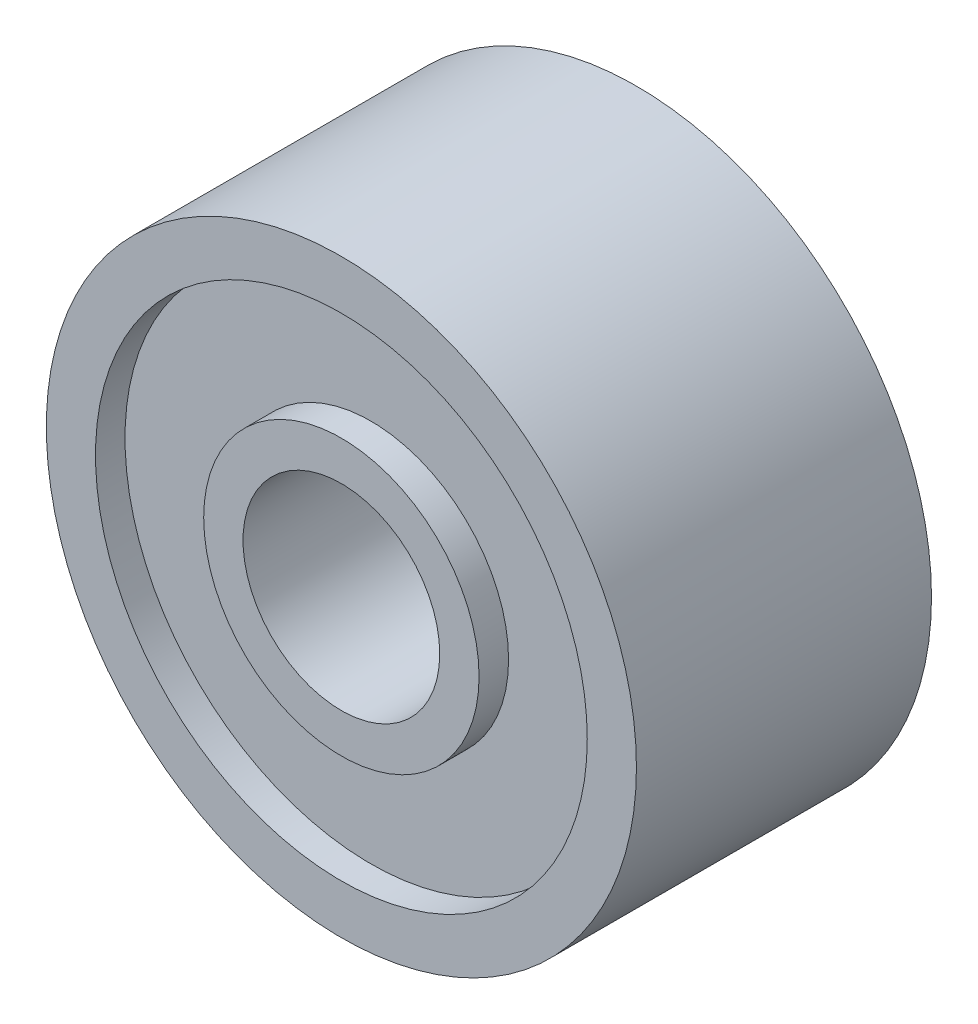
ISO-10303-21;
HEADER;
FILE_DESCRIPTION(('STEP AP214'),'2;1');
FILE_NAME('part.step','',(''),(''),'','','');
FILE_SCHEMA(('AUTOMOTIVE_DESIGN { 1 0 10303 214 1 1 1 1 }'));
ENDSEC;
DATA;
#1=APPLICATION_CONTEXT('core data for automotive mechanical design processes');
#2=APPLICATION_PROTOCOL_DEFINITION('international standard','automotive_design',2000,#1);
#3=PRODUCT_CONTEXT('',#1,'mechanical');
#4=PRODUCT('Part','Part','',(#3));
#5=PRODUCT_RELATED_PRODUCT_CATEGORY('part','',(#4));
#6=PRODUCT_DEFINITION_FORMATION('','',#4);
#7=PRODUCT_DEFINITION_CONTEXT('part definition',#1,'design');
#8=PRODUCT_DEFINITION('design','',#6,#7);
#9=PRODUCT_DEFINITION_SHAPE('','',#8);
#10=(LENGTH_UNIT() NAMED_UNIT(*) SI_UNIT(.MILLI.,.METRE.));
#11=(NAMED_UNIT(*) PLANE_ANGLE_UNIT() SI_UNIT($,.RADIAN.));
#12=(NAMED_UNIT(*) SI_UNIT($,.STERADIAN.) SOLID_ANGLE_UNIT());
#13=UNCERTAINTY_MEASURE_WITH_UNIT(LENGTH_MEASURE(1.E-05),#10,'distance_accuracy_value','');
#14=(GEOMETRIC_REPRESENTATION_CONTEXT(3) GLOBAL_UNCERTAINTY_ASSIGNED_CONTEXT((#13)) GLOBAL_UNIT_ASSIGNED_CONTEXT((#10,
#11,#12)) REPRESENTATION_CONTEXT('',''));
#15=CARTESIAN_POINT('',(0.,0.,0.));
#16=DIRECTION('',(0.,0.,1.));
#17=DIRECTION('',(1.,0.,0.));
#18=AXIS2_PLACEMENT_3D('',#15,#16,#17);
#19=CARTESIAN_POINT('',(0.,0.,0.));
#20=DIRECTION('',(0.,0.,1.));
#21=DIRECTION('',(1.,0.,0.));
#22=AXIS2_PLACEMENT_3D('',#19,#20,#21);
#23=PLANE('',#22);
#24=CARTESIAN_POINT('',(0.,0.,0.));
#25=DIRECTION('',(0.,0.,1.));
#26=DIRECTION('',(1.,0.,0.));
#27=AXIS2_PLACEMENT_3D('',#24,#25,#26);
#28=CIRCLE('',#27,1.);
#29=CARTESIAN_POINT('',(1.,0.,0.));
#30=VERTEX_POINT('',#29);
#31=EDGE_CURVE('E46',#30,#30,#28,.T.);
#32=ORIENTED_EDGE('',*,*,#31,.T.);
#33=EDGE_LOOP('',(#32));
#34=FACE_BOUND('',#33,.T.);
#35=CARTESIAN_POINT('',(0.,0.,0.));
#36=DIRECTION('',(0.,0.,1.));
#37=DIRECTION('',(1.,0.,0.));
#38=AXIS2_PLACEMENT_3D('',#35,#36,#37);
#39=CIRCLE('',#38,1.4);
#40=CARTESIAN_POINT('',(1.4,0.,0.));
#41=VERTEX_POINT('',#40);
#42=EDGE_CURVE('E70',#41,#41,#39,.T.);
#43=ORIENTED_EDGE('',*,*,#42,.F.);
#44=EDGE_LOOP('',(#43));
#45=FACE_BOUND('',#44,.T.);
#46=ADVANCED_FACE('F33',(#34,#45),#23,.F.);
#47=CARTESIAN_POINT('',(0.,0.,3.));
#48=DIRECTION('',(0.,0.,1.));
#49=DIRECTION('',(1.,0.,0.));
#50=AXIS2_PLACEMENT_3D('',#47,#48,#49);
#51=PLANE('',#50);
#52=CARTESIAN_POINT('',(0.,0.,3.));
#53=DIRECTION('',(0.,0.,1.));
#54=DIRECTION('',(1.,0.,0.));
#55=AXIS2_PLACEMENT_3D('',#52,#53,#54);
#56=CIRCLE('',#55,1.);
#57=CARTESIAN_POINT('',(1.,0.,3.));
#58=VERTEX_POINT('',#57);
#59=EDGE_CURVE('E44',#58,#58,#56,.T.);
#60=ORIENTED_EDGE('',*,*,#59,.F.);
#61=EDGE_LOOP('',(#60));
#62=FACE_BOUND('',#61,.T.);
#63=CARTESIAN_POINT('',(0.,0.,3.));
#64=DIRECTION('',(0.,0.,1.));
#65=DIRECTION('',(1.,0.,0.));
#66=AXIS2_PLACEMENT_3D('',#63,#64,#65);
#67=CIRCLE('',#66,1.4);
#68=CARTESIAN_POINT('',(1.4,0.,3.));
#69=VERTEX_POINT('',#68);
#70=EDGE_CURVE('E58',#69,#69,#67,.T.);
#71=ORIENTED_EDGE('',*,*,#70,.T.);
#72=EDGE_LOOP('',(#71));
#73=FACE_BOUND('',#72,.T.);
#74=ADVANCED_FACE('F86',(#62,#73),#51,.T.);
#75=CARTESIAN_POINT('',(0.,0.,3.));
#76=DIRECTION('',(0.,0.,1.));
#77=DIRECTION('',(1.,0.,0.));
#78=AXIS2_PLACEMENT_3D('',#75,#76,#77);
#79=CIRCLE('',#78,2.5);
#80=CARTESIAN_POINT('',(2.5,0.,3.));
#81=VERTEX_POINT('',#80);
#82=EDGE_CURVE('E52',#81,#81,#79,.T.);
#83=ORIENTED_EDGE('',*,*,#82,.F.);
#84=EDGE_LOOP('',(#83));
#85=FACE_BOUND('',#84,.T.);
#86=CARTESIAN_POINT('',(0.,0.,3.));
#87=DIRECTION('',(0.,0.,1.));
#88=DIRECTION('',(1.,0.,0.));
#89=AXIS2_PLACEMENT_3D('',#86,#87,#88);
#90=CIRCLE('',#89,3.);
#91=CARTESIAN_POINT('',(3.,0.,3.));
#92=VERTEX_POINT('',#91);
#93=EDGE_CURVE('E10',#92,#92,#90,.T.);
#94=ORIENTED_EDGE('',*,*,#93,.T.);
#95=EDGE_LOOP('',(#94));
#96=FACE_BOUND('',#95,.T.);
#97=ADVANCED_FACE('F92',(#85,#96),#51,.T.);
#98=CARTESIAN_POINT('',(0.,0.,0.));
#99=DIRECTION('',(0.,0.,1.));
#100=DIRECTION('',(1.,0.,0.));
#101=AXIS2_PLACEMENT_3D('',#98,#99,#100);
#102=CIRCLE('',#101,2.5);
#103=CARTESIAN_POINT('',(2.5,0.,0.));
#104=VERTEX_POINT('',#103);
#105=EDGE_CURVE('E64',#104,#104,#102,.T.);
#106=ORIENTED_EDGE('',*,*,#105,.T.);
#107=EDGE_LOOP('',(#106));
#108=FACE_BOUND('',#107,.T.);
#109=CARTESIAN_POINT('',(0.,0.,0.));
#110=DIRECTION('',(0.,0.,1.));
#111=DIRECTION('',(1.,0.,0.));
#112=AXIS2_PLACEMENT_3D('',#109,#110,#111);
#113=CIRCLE('',#112,3.);
#114=CARTESIAN_POINT('',(3.,0.,0.));
#115=VERTEX_POINT('',#114);
#116=EDGE_CURVE('E37',#115,#115,#113,.T.);
#117=ORIENTED_EDGE('',*,*,#116,.F.);
#118=EDGE_LOOP('',(#117));
#119=FACE_BOUND('',#118,.T.);
#120=ADVANCED_FACE('F88',(#108,#119),#23,.F.);
#121=CARTESIAN_POINT('',(0.,0.,3.));
#122=DIRECTION('',(0.,0.,-1.));
#123=DIRECTION('',(-1.,0.,0.));
#124=AXIS2_PLACEMENT_3D('',#121,#122,#123);
#125=CYLINDRICAL_SURFACE('',#124,3.);
#126=ORIENTED_EDGE('',*,*,#93,.F.);
#127=EDGE_LOOP('',(#126));
#128=FACE_BOUND('',#127,.T.);
#129=ORIENTED_EDGE('',*,*,#116,.T.);
#130=EDGE_LOOP('',(#129));
#131=FACE_BOUND('',#130,.T.);
#132=ADVANCED_FACE('F35',(#128,#131),#125,.T.);
#133=CARTESIAN_POINT('',(0.,0.,3.));
#134=DIRECTION('',(0.,0.,-1.));
#135=DIRECTION('',(-1.,0.,0.));
#136=AXIS2_PLACEMENT_3D('',#133,#134,#135);
#137=CYLINDRICAL_SURFACE('',#136,1.);
#138=ORIENTED_EDGE('',*,*,#59,.T.);
#139=EDGE_LOOP('',(#138));
#140=FACE_BOUND('',#139,.T.);
#141=ORIENTED_EDGE('',*,*,#31,.F.);
#142=EDGE_LOOP('',(#141));
#143=FACE_BOUND('',#142,.T.);
#144=ADVANCED_FACE('F101',(#140,#143),#137,.F.);
#145=CARTESIAN_POINT('',(0.,0.,2.7));
#146=DIRECTION('',(0.,0.,1.));
#147=DIRECTION('',(1.,0.,0.));
#148=AXIS2_PLACEMENT_3D('',#145,#146,#147);
#149=CYLINDRICAL_SURFACE('',#148,2.5);
#150=CARTESIAN_POINT('',(0.,0.,2.7));
#151=DIRECTION('',(0.,0.,1.));
#152=DIRECTION('',(1.,0.,0.));
#153=AXIS2_PLACEMENT_3D('',#150,#151,#152);
#154=CIRCLE('',#153,2.5);
#155=CARTESIAN_POINT('',(2.5,0.,2.7));
#156=VERTEX_POINT('',#155);
#157=EDGE_CURVE('E49',#156,#156,#154,.T.);
#158=ORIENTED_EDGE('',*,*,#157,.F.);
#159=EDGE_LOOP('',(#158));
#160=FACE_BOUND('',#159,.T.);
#161=ORIENTED_EDGE('',*,*,#82,.T.);
#162=EDGE_LOOP('',(#161));
#163=FACE_BOUND('',#162,.T.);
#164=ADVANCED_FACE('F125',(#160,#163),#149,.F.);
#165=CARTESIAN_POINT('',(0.,0.,2.7));
#166=DIRECTION('',(0.,0.,1.));
#167=DIRECTION('',(1.,0.,0.));
#168=AXIS2_PLACEMENT_3D('',#165,#166,#167);
#169=PLANE('',#168);
#170=CARTESIAN_POINT('',(0.,0.,2.7));
#171=DIRECTION('',(0.,0.,1.));
#172=DIRECTION('',(1.,0.,0.));
#173=AXIS2_PLACEMENT_3D('',#170,#171,#172);
#174=CIRCLE('',#173,1.4);
#175=CARTESIAN_POINT('',(1.4,0.,2.7));
#176=VERTEX_POINT('',#175);
#177=EDGE_CURVE('E55',#176,#176,#174,.T.);
#178=ORIENTED_EDGE('',*,*,#177,.F.);
#179=EDGE_LOOP('',(#178));
#180=FACE_BOUND('',#179,.T.);
#181=ORIENTED_EDGE('',*,*,#157,.T.);
#182=EDGE_LOOP('',(#181));
#183=FACE_BOUND('',#182,.T.);
#184=ADVANCED_FACE('F121',(#180,#183),#169,.T.);
#185=CARTESIAN_POINT('',(0.,0.,2.7));
#186=DIRECTION('',(0.,0.,1.));
#187=DIRECTION('',(1.,0.,0.));
#188=AXIS2_PLACEMENT_3D('',#185,#186,#187);
#189=CYLINDRICAL_SURFACE('',#188,1.4);
#190=ORIENTED_EDGE('',*,*,#177,.T.);
#191=EDGE_LOOP('',(#190));
#192=FACE_BOUND('',#191,.T.);
#193=ORIENTED_EDGE('',*,*,#70,.F.);
#194=EDGE_LOOP('',(#193));
#195=FACE_BOUND('',#194,.T.);
#196=ADVANCED_FACE('F115',(#192,#195),#189,.T.);
#197=CARTESIAN_POINT('',(0.,0.,0.3));
#198=DIRECTION('',(0.,0.,1.));
#199=DIRECTION('',(1.,0.,0.));
#200=AXIS2_PLACEMENT_3D('',#197,#198,#199);
#201=PLANE('',#200);
#202=CARTESIAN_POINT('',(0.,0.,0.3));
#203=DIRECTION('',(0.,0.,1.));
#204=DIRECTION('',(1.,0.,0.));
#205=AXIS2_PLACEMENT_3D('',#202,#203,#204);
#206=CIRCLE('',#205,2.5);
#207=CARTESIAN_POINT('',(2.5,0.,0.3));
#208=VERTEX_POINT('',#207);
#209=EDGE_CURVE('E61',#208,#208,#206,.T.);
#210=ORIENTED_EDGE('',*,*,#209,.F.);
#211=EDGE_LOOP('',(#210));
#212=FACE_BOUND('',#211,.T.);
#213=CARTESIAN_POINT('',(0.,0.,0.3));
#214=DIRECTION('',(0.,0.,1.));
#215=DIRECTION('',(1.,0.,0.));
#216=AXIS2_PLACEMENT_3D('',#213,#214,#215);
#217=CIRCLE('',#216,1.4);
#218=CARTESIAN_POINT('',(1.4,0.,0.3));
#219=VERTEX_POINT('',#218);
#220=EDGE_CURVE('E67',#219,#219,#217,.T.);
#221=ORIENTED_EDGE('',*,*,#220,.T.);
#222=EDGE_LOOP('',(#221));
#223=FACE_BOUND('',#222,.T.);
#224=ADVANCED_FACE('F76',(#212,#223),#201,.F.);
#225=CARTESIAN_POINT('',(0.,0.,0.3));
#226=DIRECTION('',(0.,0.,-1.));
#227=DIRECTION('',(-1.,0.,0.));
#228=AXIS2_PLACEMENT_3D('',#225,#226,#227);
#229=CYLINDRICAL_SURFACE('',#228,2.5);
#230=ORIENTED_EDGE('',*,*,#209,.T.);
#231=EDGE_LOOP('',(#230));
#232=FACE_BOUND('',#231,.T.);
#233=ORIENTED_EDGE('',*,*,#105,.F.);
#234=EDGE_LOOP('',(#233));
#235=FACE_BOUND('',#234,.T.);
#236=ADVANCED_FACE('F81',(#232,#235),#229,.F.);
#237=CARTESIAN_POINT('',(0.,0.,0.3));
#238=DIRECTION('',(0.,0.,-1.));
#239=DIRECTION('',(-1.,0.,0.));
#240=AXIS2_PLACEMENT_3D('',#237,#238,#239);
#241=CYLINDRICAL_SURFACE('',#240,1.4);
#242=ORIENTED_EDGE('',*,*,#220,.F.);
#243=EDGE_LOOP('',(#242));
#244=FACE_BOUND('',#243,.T.);
#245=ORIENTED_EDGE('',*,*,#42,.T.);
#246=EDGE_LOOP('',(#245));
#247=FACE_BOUND('',#246,.T.);
#248=ADVANCED_FACE('F78',(#244,#247),#241,.T.);
#249=CLOSED_SHELL('',(#46,#74,#97,#120,#132,#144,#164,#184,#196,#224,#236,#248));
#250=MANIFOLD_SOLID_BREP('B2',#249);
#251=ADVANCED_BREP_SHAPE_REPRESENTATION('',(#18,#250),#14);
#252=SHAPE_DEFINITION_REPRESENTATION(#9,#251);
ENDSEC;
END-ISO-10303-21;
